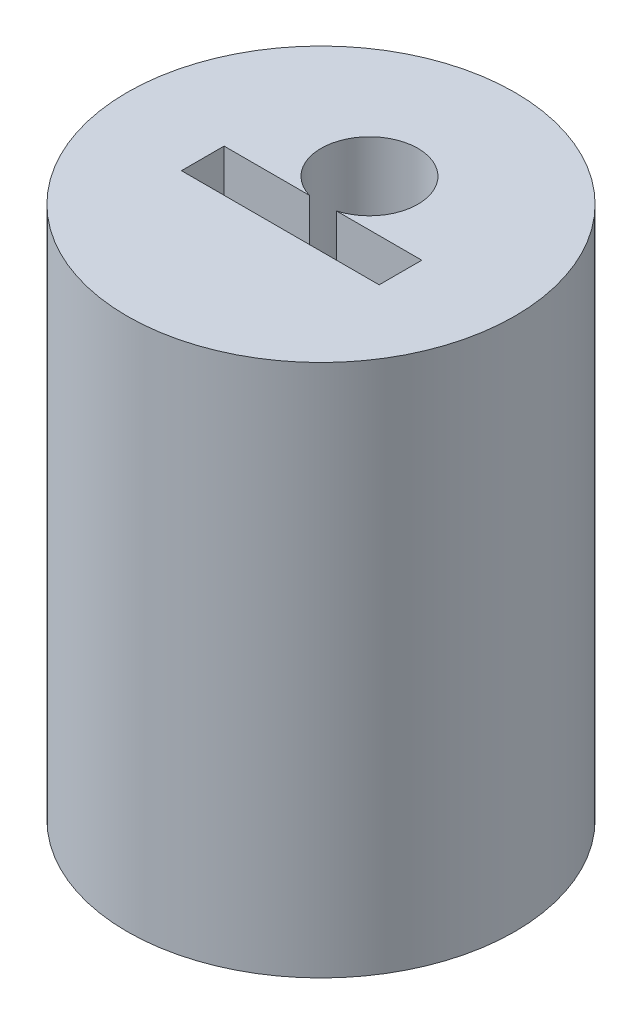
ISO-10303-21;
HEADER;
FILE_DESCRIPTION(('STEP AP214'),'2;1');
FILE_NAME('part.step','',(''),(''),'','','');
FILE_SCHEMA(('AUTOMOTIVE_DESIGN { 1 0 10303 214 1 1 1 1 }'));
ENDSEC;
DATA;
#1=APPLICATION_CONTEXT('core data for automotive mechanical design processes');
#2=APPLICATION_PROTOCOL_DEFINITION('international standard','automotive_design',2000,#1);
#3=PRODUCT_CONTEXT('',#1,'mechanical');
#4=PRODUCT('Part','Part','',(#3));
#5=PRODUCT_RELATED_PRODUCT_CATEGORY('part','',(#4));
#6=PRODUCT_DEFINITION_FORMATION('','',#4);
#7=PRODUCT_DEFINITION_CONTEXT('part definition',#1,'design');
#8=PRODUCT_DEFINITION('design','',#6,#7);
#9=PRODUCT_DEFINITION_SHAPE('','',#8);
#10=(LENGTH_UNIT() NAMED_UNIT(*) SI_UNIT(.MILLI.,.METRE.));
#11=(NAMED_UNIT(*) PLANE_ANGLE_UNIT() SI_UNIT($,.RADIAN.));
#12=(NAMED_UNIT(*) SI_UNIT($,.STERADIAN.) SOLID_ANGLE_UNIT());
#13=UNCERTAINTY_MEASURE_WITH_UNIT(LENGTH_MEASURE(1.E-05),#10,'distance_accuracy_value','');
#14=(GEOMETRIC_REPRESENTATION_CONTEXT(3) GLOBAL_UNCERTAINTY_ASSIGNED_CONTEXT((#13)) GLOBAL_UNIT_ASSIGNED_CONTEXT((#10,
#11,#12)) REPRESENTATION_CONTEXT('',''));
#15=CARTESIAN_POINT('',(0.,0.,0.));
#16=DIRECTION('',(0.,0.,1.));
#17=DIRECTION('',(1.,0.,0.));
#18=AXIS2_PLACEMENT_3D('',#15,#16,#17);
#19=CARTESIAN_POINT('',(0.,1.25,0.));
#20=DIRECTION('',(0.,1.,0.));
#21=DIRECTION('',(0.,0.,1.));
#22=AXIS2_PLACEMENT_3D('',#19,#20,#21);
#23=PLANE('',#22);
#24=CARTESIAN_POINT('',(0.,1.25,0.));
#25=DIRECTION('',(0.,1.,0.));
#26=DIRECTION('',(0.,0.,1.));
#27=AXIS2_PLACEMENT_3D('',#24,#25,#26);
#28=CIRCLE('',#27,1.);
#29=CARTESIAN_POINT('',(0.,1.25,1.));
#30=VERTEX_POINT('',#29);
#31=EDGE_CURVE('E11',#30,#30,#28,.T.);
#32=ORIENTED_EDGE('',*,*,#31,.T.);
#33=EDGE_LOOP('',(#32));
#34=FACE_BOUND('',#33,.T.);
#35=DIRECTION('',(-1.,0.,0.));
#36=VECTOR('',#35,1.);
#37=CARTESIAN_POINT('',(-0.51,1.25,-0.00999999999999992));
#38=LINE('',#37,#36);
#39=CARTESIAN_POINT('',(-0.0699999999999999,1.25,-0.00999999999999992));
#40=VERTEX_POINT('',#39);
#41=CARTESIAN_POINT('',(-0.51,1.25,-0.00999999999999992));
#42=VERTEX_POINT('',#41);
#43=EDGE_CURVE('E102',#40,#42,#38,.T.);
#44=ORIENTED_EDGE('',*,*,#43,.F.);
#45=CARTESIAN_POINT('',(0.,1.25,-0.25));
#46=DIRECTION('',(0.,1.,0.));
#47=DIRECTION('',(0.,0.,1.));
#48=AXIS2_PLACEMENT_3D('',#45,#46,#47);
#49=CIRCLE('',#48,0.25);
#50=CARTESIAN_POINT('',(0.0699999999999997,1.25,-0.00999999999999992));
#51=VERTEX_POINT('',#50);
#52=EDGE_CURVE('E82',#51,#40,#49,.T.);
#53=ORIENTED_EDGE('',*,*,#52,.F.);
#54=DIRECTION('',(-1.,0.,0.));
#55=VECTOR('',#54,1.);
#56=CARTESIAN_POINT('',(0.0699999999999997,1.25,-0.00999999999999992));
#57=LINE('',#56,#55);
#58=CARTESIAN_POINT('',(0.51,1.25,-0.00999999999999991));
#59=VERTEX_POINT('',#58);
#60=EDGE_CURVE('E53',#59,#51,#57,.T.);
#61=ORIENTED_EDGE('',*,*,#60,.F.);
#62=DIRECTION('',(0.,0.,-1.));
#63=VECTOR('',#62,1.);
#64=CARTESIAN_POINT('',(0.51,1.25,0.21));
#65=LINE('',#64,#63);
#66=CARTESIAN_POINT('',(0.51,1.25,0.21));
#67=VERTEX_POINT('',#66);
#68=EDGE_CURVE('E113',#67,#59,#65,.T.);
#69=ORIENTED_EDGE('',*,*,#68,.F.);
#70=DIRECTION('',(1.,0.,0.));
#71=VECTOR('',#70,1.);
#72=CARTESIAN_POINT('',(-0.51,1.25,0.21));
#73=LINE('',#72,#71);
#74=CARTESIAN_POINT('',(-0.51,1.25,0.21));
#75=VERTEX_POINT('',#74);
#76=EDGE_CURVE('E101',#75,#67,#73,.T.);
#77=ORIENTED_EDGE('',*,*,#76,.F.);
#78=DIRECTION('',(0.,0.,1.));
#79=VECTOR('',#78,1.);
#80=CARTESIAN_POINT('',(-0.51,1.25,0.21));
#81=LINE('',#80,#79);
#82=EDGE_CURVE('E91',#42,#75,#81,.T.);
#83=ORIENTED_EDGE('',*,*,#82,.F.);
#84=EDGE_LOOP('',(#44,#53,#61,#69,#77,#83));
#85=FACE_BOUND('',#84,.T.);
#86=ADVANCED_FACE('F32',(#34,#85),#23,.T.);
#87=CARTESIAN_POINT('',(0.,1.25,0.));
#88=DIRECTION('',(0.,-1.,0.));
#89=DIRECTION('',(0.,0.,-1.));
#90=AXIS2_PLACEMENT_3D('',#87,#88,#89);
#91=CYLINDRICAL_SURFACE('',#90,1.);
#92=ORIENTED_EDGE('',*,*,#31,.F.);
#93=EDGE_LOOP('',(#92));
#94=FACE_BOUND('',#93,.T.);
#95=CARTESIAN_POINT('',(0.,-1.5,0.));
#96=DIRECTION('',(0.,-1.,0.));
#97=DIRECTION('',(0.,0.,-1.));
#98=AXIS2_PLACEMENT_3D('',#95,#96,#97);
#99=CIRCLE('',#98,1.);
#100=CARTESIAN_POINT('',(0.,-1.5,-1.));
#101=VERTEX_POINT('',#100);
#102=EDGE_CURVE('E124',#101,#101,#99,.T.);
#103=ORIENTED_EDGE('',*,*,#102,.F.);
#104=EDGE_LOOP('',(#103));
#105=FACE_BOUND('',#104,.T.);
#106=ADVANCED_FACE('F34',(#94,#105),#91,.T.);
#107=CARTESIAN_POINT('',(0.,1.25,-0.25));
#108=DIRECTION('',(0.,-1.,0.));
#109=DIRECTION('',(0.,0.,-1.));
#110=AXIS2_PLACEMENT_3D('',#107,#108,#109);
#111=CYLINDRICAL_SURFACE('',#110,0.25);
#112=CARTESIAN_POINT('',(0.,-1.25,-0.25));
#113=DIRECTION('',(0.,1.,0.));
#114=DIRECTION('',(0.,0.,1.));
#115=AXIS2_PLACEMENT_3D('',#112,#113,#114);
#116=CIRCLE('',#115,0.25);
#117=CARTESIAN_POINT('',(0.0699999999999997,-1.25,-0.00999999999999992));
#118=VERTEX_POINT('',#117);
#119=CARTESIAN_POINT('',(-0.0699999999999999,-1.25,-0.00999999999999992));
#120=VERTEX_POINT('',#119);
#121=EDGE_CURVE('E120',#118,#120,#116,.T.);
#122=ORIENTED_EDGE('',*,*,#121,.F.);
#123=DIRECTION('',(0.,-1.,0.));
#124=VECTOR('',#123,1.);
#125=CARTESIAN_POINT('',(0.0699999999999997,1.25,-0.00999999999999992));
#126=LINE('',#125,#124);
#127=EDGE_CURVE('E119',#51,#118,#126,.T.);
#128=ORIENTED_EDGE('',*,*,#127,.F.);
#129=ORIENTED_EDGE('',*,*,#52,.T.);
#130=DIRECTION('',(0.,-1.,0.));
#131=VECTOR('',#130,1.);
#132=CARTESIAN_POINT('',(-0.0699999999999999,1.25,-0.00999999999999992));
#133=LINE('',#132,#131);
#134=EDGE_CURVE('E40',#40,#120,#133,.T.);
#135=ORIENTED_EDGE('',*,*,#134,.T.);
#136=EDGE_LOOP('',(#122,#128,#129,#135));
#137=FACE_BOUND('',#136,.T.);
#138=ADVANCED_FACE('F140',(#137),#111,.F.);
#139=CARTESIAN_POINT('',(-0.51,1.25,-0.00999999999999992));
#140=DIRECTION('',(0.,0.,1.));
#141=DIRECTION('',(1.,0.,0.));
#142=AXIS2_PLACEMENT_3D('',#139,#140,#141);
#143=PLANE('',#142);
#144=DIRECTION('',(-1.,0.,0.));
#145=VECTOR('',#144,1.);
#146=CARTESIAN_POINT('',(-0.51,-1.25,-0.00999999999999992));
#147=LINE('',#146,#145);
#148=CARTESIAN_POINT('',(-0.51,-1.25,-0.00999999999999992));
#149=VERTEX_POINT('',#148);
#150=EDGE_CURVE('E123',#120,#149,#147,.T.);
#151=ORIENTED_EDGE('',*,*,#150,.F.);
#152=ORIENTED_EDGE('',*,*,#134,.F.);
#153=ORIENTED_EDGE('',*,*,#43,.T.);
#154=DIRECTION('',(0.,-1.,0.));
#155=VECTOR('',#154,1.);
#156=CARTESIAN_POINT('',(-0.51,1.25,-0.00999999999999992));
#157=LINE('',#156,#155);
#158=EDGE_CURVE('E97',#42,#149,#157,.T.);
#159=ORIENTED_EDGE('',*,*,#158,.T.);
#160=EDGE_LOOP('',(#151,#152,#153,#159));
#161=FACE_BOUND('',#160,.T.);
#162=ADVANCED_FACE('F158',(#161),#143,.T.);
#163=CARTESIAN_POINT('',(-0.51,1.25,0.21));
#164=DIRECTION('',(1.,0.,0.));
#165=DIRECTION('',(0.,0.,-1.));
#166=AXIS2_PLACEMENT_3D('',#163,#164,#165);
#167=PLANE('',#166);
#168=DIRECTION('',(0.,0.,1.));
#169=VECTOR('',#168,1.);
#170=CARTESIAN_POINT('',(-0.51,-1.25,0.21));
#171=LINE('',#170,#169);
#172=CARTESIAN_POINT('',(-0.51,-1.25,0.21));
#173=VERTEX_POINT('',#172);
#174=EDGE_CURVE('E127',#149,#173,#171,.T.);
#175=ORIENTED_EDGE('',*,*,#174,.F.);
#176=ORIENTED_EDGE('',*,*,#158,.F.);
#177=ORIENTED_EDGE('',*,*,#82,.T.);
#178=DIRECTION('',(0.,-1.,0.));
#179=VECTOR('',#178,1.);
#180=CARTESIAN_POINT('',(-0.51,1.25,0.21));
#181=LINE('',#180,#179);
#182=EDGE_CURVE('E95',#75,#173,#181,.T.);
#183=ORIENTED_EDGE('',*,*,#182,.T.);
#184=EDGE_LOOP('',(#175,#176,#177,#183));
#185=FACE_BOUND('',#184,.T.);
#186=ADVANCED_FACE('F94',(#185),#167,.T.);
#187=CARTESIAN_POINT('',(-0.51,1.25,0.21));
#188=DIRECTION('',(0.,0.,-1.));
#189=DIRECTION('',(-1.,0.,0.));
#190=AXIS2_PLACEMENT_3D('',#187,#188,#189);
#191=PLANE('',#190);
#192=DIRECTION('',(1.,0.,0.));
#193=VECTOR('',#192,1.);
#194=CARTESIAN_POINT('',(-0.51,-1.25,0.21));
#195=LINE('',#194,#193);
#196=CARTESIAN_POINT('',(0.51,-1.25,0.21));
#197=VERTEX_POINT('',#196);
#198=EDGE_CURVE('E108',#173,#197,#195,.T.);
#199=ORIENTED_EDGE('',*,*,#198,.F.);
#200=ORIENTED_EDGE('',*,*,#182,.F.);
#201=ORIENTED_EDGE('',*,*,#76,.T.);
#202=DIRECTION('',(0.,-1.,0.));
#203=VECTOR('',#202,1.);
#204=CARTESIAN_POINT('',(0.51,1.25,0.21));
#205=LINE('',#204,#203);
#206=EDGE_CURVE('E110',#67,#197,#205,.T.);
#207=ORIENTED_EDGE('',*,*,#206,.T.);
#208=EDGE_LOOP('',(#199,#200,#201,#207));
#209=FACE_BOUND('',#208,.T.);
#210=ADVANCED_FACE('F105',(#209),#191,.T.);
#211=CARTESIAN_POINT('',(0.51,1.25,0.21));
#212=DIRECTION('',(-1.,0.,0.));
#213=DIRECTION('',(0.,0.,1.));
#214=AXIS2_PLACEMENT_3D('',#211,#212,#213);
#215=PLANE('',#214);
#216=DIRECTION('',(0.,0.,-1.));
#217=VECTOR('',#216,1.);
#218=CARTESIAN_POINT('',(0.51,-1.25,0.21));
#219=LINE('',#218,#217);
#220=CARTESIAN_POINT('',(0.51,-1.25,-0.00999999999999991));
#221=VERTEX_POINT('',#220);
#222=EDGE_CURVE('E130',#197,#221,#219,.T.);
#223=ORIENTED_EDGE('',*,*,#222,.F.);
#224=ORIENTED_EDGE('',*,*,#206,.F.);
#225=ORIENTED_EDGE('',*,*,#68,.T.);
#226=DIRECTION('',(0.,-1.,0.));
#227=VECTOR('',#226,1.);
#228=CARTESIAN_POINT('',(0.51,1.25,-0.00999999999999991));
#229=LINE('',#228,#227);
#230=EDGE_CURVE('E47',#59,#221,#229,.T.);
#231=ORIENTED_EDGE('',*,*,#230,.T.);
#232=EDGE_LOOP('',(#223,#224,#225,#231));
#233=FACE_BOUND('',#232,.T.);
#234=ADVANCED_FACE('F171',(#233),#215,.T.);
#235=CARTESIAN_POINT('',(0.0699999999999997,1.25,-0.00999999999999992));
#236=DIRECTION('',(0.,0.,1.));
#237=DIRECTION('',(1.,0.,0.));
#238=AXIS2_PLACEMENT_3D('',#235,#236,#237);
#239=PLANE('',#238);
#240=DIRECTION('',(-1.,0.,0.));
#241=VECTOR('',#240,1.);
#242=CARTESIAN_POINT('',(0.0699999999999997,-1.25,-0.00999999999999992));
#243=LINE('',#242,#241);
#244=EDGE_CURVE('E133',#221,#118,#243,.T.);
#245=ORIENTED_EDGE('',*,*,#244,.F.);
#246=ORIENTED_EDGE('',*,*,#230,.F.);
#247=ORIENTED_EDGE('',*,*,#60,.T.);
#248=ORIENTED_EDGE('',*,*,#127,.T.);
#249=EDGE_LOOP('',(#245,#246,#247,#248));
#250=FACE_BOUND('',#249,.T.);
#251=ADVANCED_FACE('F144',(#250),#239,.T.);
#252=CARTESIAN_POINT('',(0.,-1.25,0.));
#253=DIRECTION('',(0.,-1.,0.));
#254=DIRECTION('',(0.,0.,-1.));
#255=AXIS2_PLACEMENT_3D('',#252,#253,#254);
#256=PLANE('',#255);
#257=ORIENTED_EDGE('',*,*,#121,.T.);
#258=ORIENTED_EDGE('',*,*,#150,.T.);
#259=ORIENTED_EDGE('',*,*,#174,.T.);
#260=ORIENTED_EDGE('',*,*,#198,.T.);
#261=ORIENTED_EDGE('',*,*,#222,.T.);
#262=ORIENTED_EDGE('',*,*,#244,.T.);
#263=EDGE_LOOP('',(#257,#258,#259,#260,#261,#262));
#264=FACE_BOUND('',#263,.T.);
#265=ADVANCED_FACE('F143',(#264),#256,.F.);
#266=CARTESIAN_POINT('',(0.,-1.5,0.));
#267=DIRECTION('',(0.,-1.,0.));
#268=DIRECTION('',(0.,0.,-1.));
#269=AXIS2_PLACEMENT_3D('',#266,#267,#268);
#270=PLANE('',#269);
#271=ORIENTED_EDGE('',*,*,#102,.T.);
#272=EDGE_LOOP('',(#271));
#273=FACE_BOUND('',#272,.T.);
#274=ADVANCED_FACE('F150',(#273),#270,.T.);
#275=CLOSED_SHELL('',(#86,#106,#138,#162,#186,#210,#234,#251,#265,#274));
#276=MANIFOLD_SOLID_BREP('B2',#275);
#277=ADVANCED_BREP_SHAPE_REPRESENTATION('',(#18,#276),#14);
#278=SHAPE_DEFINITION_REPRESENTATION(#9,#277);
ENDSEC;
END-ISO-10303-21;
